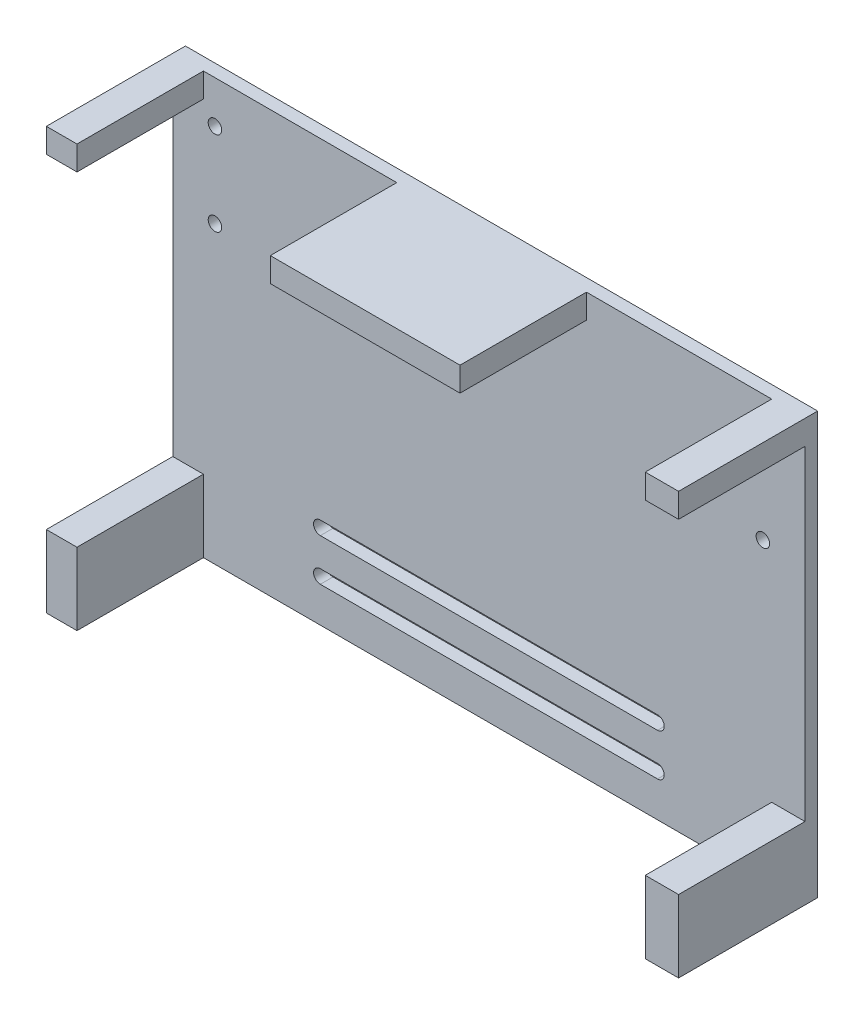
ISO-10303-21;
HEADER;
FILE_DESCRIPTION(('STEP AP214'),'2;1');
FILE_NAME('part.step','',(''),(''),'','','');
FILE_SCHEMA(('AUTOMOTIVE_DESIGN { 1 0 10303 214 1 1 1 1 }'));
ENDSEC;
DATA;
#1=APPLICATION_CONTEXT('core data for automotive mechanical design processes');
#2=APPLICATION_PROTOCOL_DEFINITION('international standard','automotive_design',2000,#1);
#3=PRODUCT_CONTEXT('',#1,'mechanical');
#4=PRODUCT('Part','Part','',(#3));
#5=PRODUCT_RELATED_PRODUCT_CATEGORY('part','',(#4));
#6=PRODUCT_DEFINITION_FORMATION('','',#4);
#7=PRODUCT_DEFINITION_CONTEXT('part definition',#1,'design');
#8=PRODUCT_DEFINITION('design','',#6,#7);
#9=PRODUCT_DEFINITION_SHAPE('','',#8);
#10=(LENGTH_UNIT() NAMED_UNIT(*) SI_UNIT(.MILLI.,.METRE.));
#11=(NAMED_UNIT(*) PLANE_ANGLE_UNIT() SI_UNIT($,.RADIAN.));
#12=(NAMED_UNIT(*) SI_UNIT($,.STERADIAN.) SOLID_ANGLE_UNIT());
#13=UNCERTAINTY_MEASURE_WITH_UNIT(LENGTH_MEASURE(1.E-05),#10,'distance_accuracy_value','');
#14=(GEOMETRIC_REPRESENTATION_CONTEXT(3) GLOBAL_UNCERTAINTY_ASSIGNED_CONTEXT((#13)) GLOBAL_UNIT_ASSIGNED_CONTEXT((#10,
#11,#12)) REPRESENTATION_CONTEXT('',''));
#15=CARTESIAN_POINT('',(0.,0.,0.));
#16=DIRECTION('',(0.,0.,1.));
#17=DIRECTION('',(1.,0.,0.));
#18=AXIS2_PLACEMENT_3D('',#15,#16,#17);
#19=CARTESIAN_POINT('',(0.,0.,3.));
#20=DIRECTION('',(0.,0.,1.));
#21=DIRECTION('',(1.,0.,0.));
#22=AXIS2_PLACEMENT_3D('',#19,#20,#21);
#23=PLANE('',#22);
#24=CARTESIAN_POINT('',(58.2122370936902,-38.671684116065,3.));
#25=DIRECTION('',(0.,0.,1.));
#26=DIRECTION('',(1.,0.,0.));
#27=AXIS2_PLACEMENT_3D('',#24,#25,#26);
#28=CIRCLE('',#27,1.59999999999997);
#29=CARTESIAN_POINT('',(58.2122370936902,-40.271684116065,3.));
#30=VERTEX_POINT('',#29);
#31=CARTESIAN_POINT('',(58.2122370936902,-37.0716841160651,3.));
#32=VERTEX_POINT('',#31);
#33=EDGE_CURVE('E315',#30,#32,#28,.T.);
#34=ORIENTED_EDGE('',*,*,#33,.F.);
#35=DIRECTION('',(1.,0.,0.));
#36=VECTOR('',#35,1.);
#37=CARTESIAN_POINT('',(0.,-40.271684116065,3.));
#38=LINE('',#37,#36);
#39=CARTESIAN_POINT('',(-21.7877629063098,-40.271684116065,3.));
#40=VERTEX_POINT('',#39);
#41=EDGE_CURVE('E307',#40,#30,#38,.T.);
#42=ORIENTED_EDGE('',*,*,#41,.F.);
#43=CARTESIAN_POINT('',(-21.7877629063097,-38.671684116065,3.));
#44=DIRECTION('',(0.,0.,1.));
#45=DIRECTION('',(1.,0.,0.));
#46=AXIS2_PLACEMENT_3D('',#43,#44,#45);
#47=CIRCLE('',#46,1.59999999999997);
#48=CARTESIAN_POINT('',(-21.7877629063098,-37.071684116065,3.));
#49=VERTEX_POINT('',#48);
#50=EDGE_CURVE('E236',#49,#40,#47,.T.);
#51=ORIENTED_EDGE('',*,*,#50,.F.);
#52=DIRECTION('',(-1.,0.,0.));
#53=VECTOR('',#52,1.);
#54=CARTESIAN_POINT('',(0.,-37.071684116065,3.));
#55=LINE('',#54,#53);
#56=EDGE_CURVE('E312',#32,#49,#55,.T.);
#57=ORIENTED_EDGE('',*,*,#56,.F.);
#58=EDGE_LOOP('',(#34,#42,#51,#57));
#59=FACE_BOUND('',#58,.T.);
#60=CARTESIAN_POINT('',(58.2122370936902,-48.671684116065,3.));
#61=DIRECTION('',(0.,0.,1.));
#62=DIRECTION('',(1.,0.,0.));
#63=AXIS2_PLACEMENT_3D('',#60,#61,#62);
#64=CIRCLE('',#63,1.59999999999997);
#65=CARTESIAN_POINT('',(58.2122370936902,-50.271684116065,3.));
#66=VERTEX_POINT('',#65);
#67=CARTESIAN_POINT('',(58.2122370936902,-47.071684116065,3.));
#68=VERTEX_POINT('',#67);
#69=EDGE_CURVE('E304',#66,#68,#64,.T.);
#70=ORIENTED_EDGE('',*,*,#69,.F.);
#71=DIRECTION('',(1.,0.,0.));
#72=VECTOR('',#71,1.);
#73=CARTESIAN_POINT('',(0.,-50.2716841160649,3.));
#74=LINE('',#73,#72);
#75=CARTESIAN_POINT('',(-21.7877629063098,-50.2716841160649,3.));
#76=VERTEX_POINT('',#75);
#77=EDGE_CURVE('E265',#76,#66,#74,.T.);
#78=ORIENTED_EDGE('',*,*,#77,.F.);
#79=CARTESIAN_POINT('',(-21.7877629063097,-48.671684116065,3.));
#80=DIRECTION('',(0.,0.,1.));
#81=DIRECTION('',(1.,0.,0.));
#82=AXIS2_PLACEMENT_3D('',#79,#80,#81);
#83=CIRCLE('',#82,1.59999999999997);
#84=CARTESIAN_POINT('',(-21.7877629063098,-47.071684116065,3.));
#85=VERTEX_POINT('',#84);
#86=EDGE_CURVE('E298',#85,#76,#83,.T.);
#87=ORIENTED_EDGE('',*,*,#86,.F.);
#88=DIRECTION('',(-1.,0.,0.));
#89=VECTOR('',#88,1.);
#90=CARTESIAN_POINT('',(0.,-47.071684116065,3.));
#91=LINE('',#90,#89);
#92=EDGE_CURVE('E301',#68,#85,#91,.T.);
#93=ORIENTED_EDGE('',*,*,#92,.F.);
#94=EDGE_LOOP('',(#70,#78,#87,#93));
#95=FACE_BOUND('',#94,.T.);
#96=DIRECTION('',(-1.,0.,0.));
#97=VECTOR('',#96,1.);
#98=CARTESIAN_POINT('',(-56.7877629063097,-41.5196573009403,3.));
#99=LINE('',#98,#97);
#100=CARTESIAN_POINT('',(-49.5172821614652,-41.5196573009403,3.));
#101=VERTEX_POINT('',#100);
#102=CARTESIAN_POINT('',(-56.7877629063097,-41.5196573009403,3.));
#103=VERTEX_POINT('',#102);
#104=EDGE_CURVE('E434',#101,#103,#99,.T.);
#105=ORIENTED_EDGE('',*,*,#104,.F.);
#106=DIRECTION('',(0.,1.,0.));
#107=VECTOR('',#106,1.);
#108=CARTESIAN_POINT('',(-49.5172821614652,-58.671684116065,3.));
#109=LINE('',#108,#107);
#110=CARTESIAN_POINT('',(-49.5172821614652,-58.671684116065,3.));
#111=VERTEX_POINT('',#110);
#112=EDGE_CURVE('E393',#111,#101,#109,.T.);
#113=ORIENTED_EDGE('',*,*,#112,.F.);
#114=DIRECTION('',(1.,0.,0.));
#115=VECTOR('',#114,1.);
#116=CARTESIAN_POINT('',(-56.7877629063097,-58.671684116065,3.));
#117=LINE('',#116,#115);
#118=CARTESIAN_POINT('',(85.311019940881,-58.671684116065,3.));
#119=VERTEX_POINT('',#118);
#120=EDGE_CURVE('E529',#111,#119,#117,.T.);
#121=ORIENTED_EDGE('',*,*,#120,.T.);
#122=DIRECTION('',(0.,-1.,0.));
#123=VECTOR('',#122,1.);
#124=CARTESIAN_POINT('',(85.311019940881,-58.671684116065,3.));
#125=LINE('',#124,#123);
#126=CARTESIAN_POINT('',(85.311019940881,-41.5196573009403,3.));
#127=VERTEX_POINT('',#126);
#128=EDGE_CURVE('E402',#127,#119,#125,.T.);
#129=ORIENTED_EDGE('',*,*,#128,.F.);
#130=DIRECTION('',(-1.,0.,0.));
#131=VECTOR('',#130,1.);
#132=CARTESIAN_POINT('',(93.2122370936903,-41.5196573009403,3.));
#133=LINE('',#132,#131);
#134=CARTESIAN_POINT('',(93.2122370936903,-41.5196573009403,3.));
#135=VERTEX_POINT('',#134);
#136=EDGE_CURVE('E360',#135,#127,#133,.T.);
#137=ORIENTED_EDGE('',*,*,#136,.F.);
#138=DIRECTION('',(0.,1.,0.));
#139=VECTOR('',#138,1.);
#140=CARTESIAN_POINT('',(93.2122370936902,41.328315883935,3.));
#141=LINE('',#140,#139);
#142=CARTESIAN_POINT('',(93.2122370936902,35.5739545762803,3.));
#143=VERTEX_POINT('',#142);
#144=EDGE_CURVE('E533',#135,#143,#141,.T.);
#145=ORIENTED_EDGE('',*,*,#144,.T.);
#146=DIRECTION('',(1.,0.,0.));
#147=VECTOR('',#146,1.);
#148=CARTESIAN_POINT('',(93.2122370936902,35.5739545762803,3.));
#149=LINE('',#148,#147);
#150=CARTESIAN_POINT('',(85.311019940881,35.5739545762803,3.));
#151=VERTEX_POINT('',#150);
#152=EDGE_CURVE('E369',#151,#143,#149,.T.);
#153=ORIENTED_EDGE('',*,*,#152,.F.);
#154=DIRECTION('',(0.,-1.,0.));
#155=VECTOR('',#154,1.);
#156=CARTESIAN_POINT('',(85.311019940881,41.328315883935,3.));
#157=LINE('',#156,#155);
#158=CARTESIAN_POINT('',(85.311019940881,41.328315883935,3.));
#159=VERTEX_POINT('',#158);
#160=EDGE_CURVE('E324',#159,#151,#157,.T.);
#161=ORIENTED_EDGE('',*,*,#160,.F.);
#162=DIRECTION('',(-1.,0.,0.));
#163=VECTOR('',#162,1.);
#164=CARTESIAN_POINT('',(-56.7877629063098,41.328315883935,3.));
#165=LINE('',#164,#163);
#166=CARTESIAN_POINT('',(41.3610431680918,41.328315883935,3.));
#167=VERTEX_POINT('',#166);
#168=EDGE_CURVE('E539',#159,#167,#165,.T.);
#169=ORIENTED_EDGE('',*,*,#168,.T.);
#170=DIRECTION('',(0.,1.,0.));
#171=VECTOR('',#170,1.);
#172=CARTESIAN_POINT('',(41.3610431680918,41.328315883935,3.));
#173=LINE('',#172,#171);
#174=CARTESIAN_POINT('',(41.3610431680918,35.5739545762803,3.));
#175=VERTEX_POINT('',#174);
#176=EDGE_CURVE('E458',#175,#167,#173,.T.);
#177=ORIENTED_EDGE('',*,*,#176,.F.);
#178=DIRECTION('',(1.,0.,0.));
#179=VECTOR('',#178,1.);
#180=CARTESIAN_POINT('',(-3.65186093510339,35.5739545762803,3.));
#181=LINE('',#180,#179);
#182=CARTESIAN_POINT('',(-3.65186093510339,35.5739545762803,3.));
#183=VERTEX_POINT('',#182);
#184=EDGE_CURVE('E471',#183,#175,#181,.T.);
#185=ORIENTED_EDGE('',*,*,#184,.F.);
#186=DIRECTION('',(0.,-1.,0.));
#187=VECTOR('',#186,1.);
#188=CARTESIAN_POINT('',(-3.65186093510339,41.328315883935,3.));
#189=LINE('',#188,#187);
#190=CARTESIAN_POINT('',(-3.65186093510339,41.328315883935,3.));
#191=VERTEX_POINT('',#190);
#192=EDGE_CURVE('E342',#191,#183,#189,.T.);
#193=ORIENTED_EDGE('',*,*,#192,.F.);
#194=CARTESIAN_POINT('',(-49.5172821614652,41.328315883935,3.));
#195=VERTEX_POINT('',#194);
#196=EDGE_CURVE('E536',#191,#195,#165,.T.);
#197=ORIENTED_EDGE('',*,*,#196,.T.);
#198=DIRECTION('',(0.,1.,0.));
#199=VECTOR('',#198,1.);
#200=CARTESIAN_POINT('',(-49.5172821614652,41.328315883935,3.));
#201=LINE('',#200,#199);
#202=CARTESIAN_POINT('',(-49.5172821614652,35.5739545762803,3.));
#203=VERTEX_POINT('',#202);
#204=EDGE_CURVE('E333',#203,#195,#201,.T.);
#205=ORIENTED_EDGE('',*,*,#204,.F.);
#206=DIRECTION('',(1.,0.,0.));
#207=VECTOR('',#206,1.);
#208=CARTESIAN_POINT('',(-56.7877629063098,35.5739545762803,3.));
#209=LINE('',#208,#207);
#210=CARTESIAN_POINT('',(-56.7877629063098,35.5739545762803,3.));
#211=VERTEX_POINT('',#210);
#212=EDGE_CURVE('E337',#211,#203,#209,.T.);
#213=ORIENTED_EDGE('',*,*,#212,.F.);
#214=DIRECTION('',(0.,-1.,0.));
#215=VECTOR('',#214,1.);
#216=CARTESIAN_POINT('',(-56.7877629063098,41.328315883935,3.));
#217=LINE('',#216,#215);
#218=EDGE_CURVE('E526',#211,#103,#217,.T.);
#219=ORIENTED_EDGE('',*,*,#218,.T.);
#220=EDGE_LOOP('',(#105,#113,#121,#129,#137,#145,#153,#161,#169,#177,#185,#193,#197,#205,#213,#219));
#221=FACE_BOUND('',#220,.T.);
#222=CARTESIAN_POINT('',(83.2122370936903,11.3283158839351,3.));
#223=DIRECTION('',(0.,0.,1.));
#224=DIRECTION('',(-1.,0.,0.));
#225=AXIS2_PLACEMENT_3D('',#222,#223,#224);
#226=CIRCLE('',#225,1.59999999999999);
#227=CARTESIAN_POINT('',(81.6122370936903,11.3283158839351,3.));
#228=VERTEX_POINT('',#227);
#229=EDGE_CURVE('E502',#228,#228,#226,.T.);
#230=ORIENTED_EDGE('',*,*,#229,.F.);
#231=EDGE_LOOP('',(#230));
#232=FACE_BOUND('',#231,.T.);
#233=CARTESIAN_POINT('',(-46.7877629063098,31.328315883935,3.));
#234=DIRECTION('',(0.,0.,1.));
#235=DIRECTION('',(1.,0.,0.));
#236=AXIS2_PLACEMENT_3D('',#233,#234,#235);
#237=CIRCLE('',#236,1.6);
#238=CARTESIAN_POINT('',(-45.1877629063098,31.328315883935,3.));
#239=VERTEX_POINT('',#238);
#240=EDGE_CURVE('E518',#239,#239,#237,.T.);
#241=ORIENTED_EDGE('',*,*,#240,.F.);
#242=EDGE_LOOP('',(#241));
#243=FACE_BOUND('',#242,.T.);
#244=CARTESIAN_POINT('',(-46.7877629063098,11.328315883935,3.));
#245=DIRECTION('',(0.,0.,1.));
#246=DIRECTION('',(1.,0.,0.));
#247=AXIS2_PLACEMENT_3D('',#244,#245,#246);
#248=CIRCLE('',#247,1.6);
#249=CARTESIAN_POINT('',(-45.1877629063098,11.328315883935,3.));
#250=VERTEX_POINT('',#249);
#251=EDGE_CURVE('E510',#250,#250,#248,.T.);
#252=ORIENTED_EDGE('',*,*,#251,.F.);
#253=EDGE_LOOP('',(#252));
#254=FACE_BOUND('',#253,.T.);
#255=CARTESIAN_POINT('',(83.2122370936902,31.3283158839351,3.));
#256=DIRECTION('',(0.,0.,1.));
#257=DIRECTION('',(-1.,0.,0.));
#258=AXIS2_PLACEMENT_3D('',#255,#256,#257);
#259=CIRCLE('',#258,1.59999999999999);
#260=CARTESIAN_POINT('',(81.6122370936903,31.3283158839351,3.));
#261=VERTEX_POINT('',#260);
#262=EDGE_CURVE('E494',#261,#261,#259,.T.);
#263=ORIENTED_EDGE('',*,*,#262,.F.);
#264=EDGE_LOOP('',(#263));
#265=FACE_BOUND('',#264,.T.);
#266=ADVANCED_FACE('F45',(#59,#95,#221,#232,#243,#254,#265),#23,.T.);
#267=CARTESIAN_POINT('',(0.,0.,0.));
#268=DIRECTION('',(0.,0.,1.));
#269=DIRECTION('',(1.,0.,0.));
#270=AXIS2_PLACEMENT_3D('',#267,#268,#269);
#271=PLANE('',#270);
#272=DIRECTION('',(-1.,0.,0.));
#273=VECTOR('',#272,1.);
#274=CARTESIAN_POINT('',(58.2122370936902,-40.271684116065,0.));
#275=LINE('',#274,#273);
#276=CARTESIAN_POINT('',(58.2122370936902,-40.271684116065,0.));
#277=VERTEX_POINT('',#276);
#278=CARTESIAN_POINT('',(-21.7877629063098,-40.271684116065,0.));
#279=VERTEX_POINT('',#278);
#280=EDGE_CURVE('E244',#277,#279,#275,.T.);
#281=ORIENTED_EDGE('',*,*,#280,.F.);
#282=CARTESIAN_POINT('',(58.2122370936902,-38.671684116065,0.));
#283=DIRECTION('',(0.,0.,-1.));
#284=DIRECTION('',(-1.,0.,0.));
#285=AXIS2_PLACEMENT_3D('',#282,#283,#284);
#286=CIRCLE('',#285,1.59999999999997);
#287=CARTESIAN_POINT('',(58.2122370936902,-37.0716841160651,0.));
#288=VERTEX_POINT('',#287);
#289=EDGE_CURVE('E250',#288,#277,#286,.T.);
#290=ORIENTED_EDGE('',*,*,#289,.F.);
#291=DIRECTION('',(1.,0.,0.));
#292=VECTOR('',#291,1.);
#293=CARTESIAN_POINT('',(58.2122370936902,-37.0716841160651,0.));
#294=LINE('',#293,#292);
#295=CARTESIAN_POINT('',(-21.7877629063098,-37.071684116065,0.));
#296=VERTEX_POINT('',#295);
#297=EDGE_CURVE('E255',#296,#288,#294,.T.);
#298=ORIENTED_EDGE('',*,*,#297,.F.);
#299=CARTESIAN_POINT('',(-21.7877629063097,-38.671684116065,0.));
#300=DIRECTION('',(0.,0.,-1.));
#301=DIRECTION('',(-1.,0.,0.));
#302=AXIS2_PLACEMENT_3D('',#299,#300,#301);
#303=CIRCLE('',#302,1.59999999999997);
#304=EDGE_CURVE('E233',#279,#296,#303,.T.);
#305=ORIENTED_EDGE('',*,*,#304,.F.);
#306=EDGE_LOOP('',(#281,#290,#298,#305));
#307=FACE_BOUND('',#306,.T.);
#308=DIRECTION('',(-1.,0.,0.));
#309=VECTOR('',#308,1.);
#310=CARTESIAN_POINT('',(58.2122370936902,-50.271684116065,0.));
#311=LINE('',#310,#309);
#312=CARTESIAN_POINT('',(58.2122370936902,-50.271684116065,0.));
#313=VERTEX_POINT('',#312);
#314=CARTESIAN_POINT('',(-21.7877629063098,-50.271684116065,0.));
#315=VERTEX_POINT('',#314);
#316=EDGE_CURVE('E290',#313,#315,#311,.T.);
#317=ORIENTED_EDGE('',*,*,#316,.F.);
#318=CARTESIAN_POINT('',(58.2122370936902,-48.671684116065,0.));
#319=DIRECTION('',(0.,0.,-1.));
#320=DIRECTION('',(-1.,0.,0.));
#321=AXIS2_PLACEMENT_3D('',#318,#319,#320);
#322=CIRCLE('',#321,1.59999999999997);
#323=CARTESIAN_POINT('',(58.2122370936902,-47.071684116065,0.));
#324=VERTEX_POINT('',#323);
#325=EDGE_CURVE('E293',#324,#313,#322,.T.);
#326=ORIENTED_EDGE('',*,*,#325,.F.);
#327=DIRECTION('',(1.,0.,0.));
#328=VECTOR('',#327,1.);
#329=CARTESIAN_POINT('',(58.2122370936902,-47.071684116065,0.));
#330=LINE('',#329,#328);
#331=CARTESIAN_POINT('',(-21.7877629063098,-47.071684116065,0.));
#332=VERTEX_POINT('',#331);
#333=EDGE_CURVE('E274',#332,#324,#330,.T.);
#334=ORIENTED_EDGE('',*,*,#333,.F.);
#335=CARTESIAN_POINT('',(-21.7877629063097,-48.671684116065,0.));
#336=DIRECTION('',(0.,0.,-1.));
#337=DIRECTION('',(-1.,0.,0.));
#338=AXIS2_PLACEMENT_3D('',#335,#336,#337);
#339=CIRCLE('',#338,1.59999999999997);
#340=EDGE_CURVE('E286',#315,#332,#339,.T.);
#341=ORIENTED_EDGE('',*,*,#340,.F.);
#342=EDGE_LOOP('',(#317,#326,#334,#341));
#343=FACE_BOUND('',#342,.T.);
#344=DIRECTION('',(0.,-1.,0.));
#345=VECTOR('',#344,1.);
#346=CARTESIAN_POINT('',(-56.7877629063098,41.328315883935,0.));
#347=LINE('',#346,#345);
#348=CARTESIAN_POINT('',(-56.7877629063098,41.328315883935,0.));
#349=VERTEX_POINT('',#348);
#350=CARTESIAN_POINT('',(-56.7877629063097,-58.671684116065,0.));
#351=VERTEX_POINT('',#350);
#352=EDGE_CURVE('E522',#349,#351,#347,.T.);
#353=ORIENTED_EDGE('',*,*,#352,.F.);
#354=DIRECTION('',(-1.,0.,0.));
#355=VECTOR('',#354,1.);
#356=CARTESIAN_POINT('',(-56.7877629063098,41.328315883935,0.));
#357=LINE('',#356,#355);
#358=CARTESIAN_POINT('',(93.2122370936902,41.328315883935,0.));
#359=VERTEX_POINT('',#358);
#360=EDGE_CURVE('E530',#359,#349,#357,.T.);
#361=ORIENTED_EDGE('',*,*,#360,.F.);
#362=DIRECTION('',(0.,1.,0.));
#363=VECTOR('',#362,1.);
#364=CARTESIAN_POINT('',(93.2122370936902,41.328315883935,0.));
#365=LINE('',#364,#363);
#366=CARTESIAN_POINT('',(93.2122370936903,-58.671684116065,0.));
#367=VERTEX_POINT('',#366);
#368=EDGE_CURVE('E546',#367,#359,#365,.T.);
#369=ORIENTED_EDGE('',*,*,#368,.F.);
#370=DIRECTION('',(1.,0.,0.));
#371=VECTOR('',#370,1.);
#372=CARTESIAN_POINT('',(-56.7877629063097,-58.671684116065,0.));
#373=LINE('',#372,#371);
#374=EDGE_CURVE('E543',#351,#367,#373,.T.);
#375=ORIENTED_EDGE('',*,*,#374,.F.);
#376=EDGE_LOOP('',(#353,#361,#369,#375));
#377=FACE_BOUND('',#376,.T.);
#378=CARTESIAN_POINT('',(-46.7877629063098,31.328315883935,0.));
#379=DIRECTION('',(0.,0.,1.));
#380=DIRECTION('',(1.,0.,0.));
#381=AXIS2_PLACEMENT_3D('',#378,#379,#380);
#382=CIRCLE('',#381,1.6);
#383=CARTESIAN_POINT('',(-45.1877629063098,31.328315883935,0.));
#384=VERTEX_POINT('',#383);
#385=EDGE_CURVE('E514',#384,#384,#382,.T.);
#386=ORIENTED_EDGE('',*,*,#385,.T.);
#387=EDGE_LOOP('',(#386));
#388=FACE_BOUND('',#387,.T.);
#389=CARTESIAN_POINT('',(-46.7877629063098,11.328315883935,0.));
#390=DIRECTION('',(0.,0.,1.));
#391=DIRECTION('',(1.,0.,0.));
#392=AXIS2_PLACEMENT_3D('',#389,#390,#391);
#393=CIRCLE('',#392,1.6);
#394=CARTESIAN_POINT('',(-45.1877629063098,11.328315883935,0.));
#395=VERTEX_POINT('',#394);
#396=EDGE_CURVE('E506',#395,#395,#393,.T.);
#397=ORIENTED_EDGE('',*,*,#396,.T.);
#398=EDGE_LOOP('',(#397));
#399=FACE_BOUND('',#398,.T.);
#400=CARTESIAN_POINT('',(83.2122370936903,11.3283158839351,0.));
#401=DIRECTION('',(0.,0.,1.));
#402=DIRECTION('',(-1.,0.,0.));
#403=AXIS2_PLACEMENT_3D('',#400,#401,#402);
#404=CIRCLE('',#403,1.59999999999999);
#405=CARTESIAN_POINT('',(81.6122370936903,11.3283158839351,0.));
#406=VERTEX_POINT('',#405);
#407=EDGE_CURVE('E498',#406,#406,#404,.T.);
#408=ORIENTED_EDGE('',*,*,#407,.T.);
#409=EDGE_LOOP('',(#408));
#410=FACE_BOUND('',#409,.T.);
#411=CARTESIAN_POINT('',(83.2122370936902,31.3283158839351,0.));
#412=DIRECTION('',(0.,0.,1.));
#413=DIRECTION('',(-1.,0.,0.));
#414=AXIS2_PLACEMENT_3D('',#411,#412,#413);
#415=CIRCLE('',#414,1.59999999999999);
#416=CARTESIAN_POINT('',(81.6122370936903,31.3283158839351,0.));
#417=VERTEX_POINT('',#416);
#418=EDGE_CURVE('E493',#417,#417,#415,.T.);
#419=ORIENTED_EDGE('',*,*,#418,.T.);
#420=EDGE_LOOP('',(#419));
#421=FACE_BOUND('',#420,.T.);
#422=ADVANCED_FACE('F252',(#307,#343,#377,#388,#399,#410,#421),#271,.F.);
#423=CARTESIAN_POINT('',(-56.7877629063098,41.328315883935,3.));
#424=DIRECTION('',(1.,0.,0.));
#425=DIRECTION('',(0.,1.,0.));
#426=AXIS2_PLACEMENT_3D('',#423,#424,#425);
#427=PLANE('',#426);
#428=ORIENTED_EDGE('',*,*,#352,.T.);
#429=DIRECTION('',(0.,0.,-1.));
#430=VECTOR('',#429,1.);
#431=CARTESIAN_POINT('',(-56.7877629063097,-58.671684116065,3.));
#432=LINE('',#431,#430);
#433=CARTESIAN_POINT('',(-56.7877629063097,-58.671684116065,33.));
#434=VERTEX_POINT('',#433);
#435=EDGE_CURVE('E11',#434,#351,#432,.T.);
#436=ORIENTED_EDGE('',*,*,#435,.F.);
#437=DIRECTION('',(0.,-1.,0.));
#438=VECTOR('',#437,1.);
#439=CARTESIAN_POINT('',(-56.7877629063097,-58.671684116065,33.));
#440=LINE('',#439,#438);
#441=CARTESIAN_POINT('',(-56.7877629063097,-41.5196573009403,33.));
#442=VERTEX_POINT('',#441);
#443=EDGE_CURVE('E438',#442,#434,#440,.T.);
#444=ORIENTED_EDGE('',*,*,#443,.F.);
#445=DIRECTION('',(0.,0.,-1.));
#446=VECTOR('',#445,1.);
#447=CARTESIAN_POINT('',(-56.7877629063097,-41.5196573009403,33.));
#448=LINE('',#447,#446);
#449=EDGE_CURVE('E429',#442,#103,#448,.T.);
#450=ORIENTED_EDGE('',*,*,#449,.T.);
#451=ORIENTED_EDGE('',*,*,#218,.F.);
#452=DIRECTION('',(0.,0.,-1.));
#453=VECTOR('',#452,1.);
#454=CARTESIAN_POINT('',(-56.7877629063098,35.5739545762803,33.));
#455=LINE('',#454,#453);
#456=CARTESIAN_POINT('',(-56.7877629063098,35.5739545762803,33.));
#457=VERTEX_POINT('',#456);
#458=EDGE_CURVE('E319',#457,#211,#455,.T.);
#459=ORIENTED_EDGE('',*,*,#458,.F.);
#460=DIRECTION('',(0.,-1.,0.));
#461=VECTOR('',#460,1.);
#462=CARTESIAN_POINT('',(-56.7877629063098,41.328315883935,33.));
#463=LINE('',#462,#461);
#464=CARTESIAN_POINT('',(-56.7877629063098,41.328315883935,33.));
#465=VERTEX_POINT('',#464);
#466=EDGE_CURVE('E338',#465,#457,#463,.T.);
#467=ORIENTED_EDGE('',*,*,#466,.F.);
#468=DIRECTION('',(0.,0.,-1.));
#469=VECTOR('',#468,1.);
#470=CARTESIAN_POINT('',(-56.7877629063098,41.328315883935,3.));
#471=LINE('',#470,#469);
#472=EDGE_CURVE('E551',#465,#349,#471,.T.);
#473=ORIENTED_EDGE('',*,*,#472,.T.);
#474=EDGE_LOOP('',(#428,#436,#444,#450,#451,#459,#467,#473));
#475=FACE_BOUND('',#474,.T.);
#476=ADVANCED_FACE('F47',(#475),#427,.F.);
#477=CARTESIAN_POINT('',(-56.7877629063097,-58.671684116065,3.));
#478=DIRECTION('',(0.,1.,0.));
#479=DIRECTION('',(-1.,0.,0.));
#480=AXIS2_PLACEMENT_3D('',#477,#478,#479);
#481=PLANE('',#480);
#482=ORIENTED_EDGE('',*,*,#374,.T.);
#483=DIRECTION('',(0.,0.,-1.));
#484=VECTOR('',#483,1.);
#485=CARTESIAN_POINT('',(93.2122370936903,-58.671684116065,3.));
#486=LINE('',#485,#484);
#487=CARTESIAN_POINT('',(93.2122370936903,-58.671684116065,33.));
#488=VERTEX_POINT('',#487);
#489=EDGE_CURVE('E54',#488,#367,#486,.T.);
#490=ORIENTED_EDGE('',*,*,#489,.F.);
#491=DIRECTION('',(1.,0.,0.));
#492=VECTOR('',#491,1.);
#493=CARTESIAN_POINT('',(93.2122370936903,-58.671684116065,33.));
#494=LINE('',#493,#492);
#495=CARTESIAN_POINT('',(85.311019940881,-58.671684116065,33.));
#496=VERTEX_POINT('',#495);
#497=EDGE_CURVE('E401',#496,#488,#494,.T.);
#498=ORIENTED_EDGE('',*,*,#497,.F.);
#499=DIRECTION('',(0.,0.,-1.));
#500=VECTOR('',#499,1.);
#501=CARTESIAN_POINT('',(85.311019940881,-58.671684116065,33.));
#502=LINE('',#501,#500);
#503=EDGE_CURVE('E397',#496,#119,#502,.T.);
#504=ORIENTED_EDGE('',*,*,#503,.T.);
#505=ORIENTED_EDGE('',*,*,#120,.F.);
#506=DIRECTION('',(0.,0.,-1.));
#507=VECTOR('',#506,1.);
#508=CARTESIAN_POINT('',(-49.5172821614652,-58.671684116065,33.));
#509=LINE('',#508,#507);
#510=CARTESIAN_POINT('',(-49.5172821614652,-58.671684116065,33.));
#511=VERTEX_POINT('',#510);
#512=EDGE_CURVE('E318',#511,#111,#509,.T.);
#513=ORIENTED_EDGE('',*,*,#512,.F.);
#514=DIRECTION('',(1.,0.,0.));
#515=VECTOR('',#514,1.);
#516=CARTESIAN_POINT('',(-56.7877629063097,-58.671684116065,33.));
#517=LINE('',#516,#515);
#518=EDGE_CURVE('E447',#434,#511,#517,.T.);
#519=ORIENTED_EDGE('',*,*,#518,.F.);
#520=ORIENTED_EDGE('',*,*,#435,.T.);
#521=EDGE_LOOP('',(#482,#490,#498,#504,#505,#513,#519,#520));
#522=FACE_BOUND('',#521,.T.);
#523=ADVANCED_FACE('F621',(#522),#481,.F.);
#524=CARTESIAN_POINT('',(93.2122370936902,41.328315883935,3.));
#525=DIRECTION('',(-1.,0.,0.));
#526=DIRECTION('',(0.,-1.,0.));
#527=AXIS2_PLACEMENT_3D('',#524,#525,#526);
#528=PLANE('',#527);
#529=ORIENTED_EDGE('',*,*,#368,.T.);
#530=DIRECTION('',(0.,0.,-1.));
#531=VECTOR('',#530,1.);
#532=CARTESIAN_POINT('',(93.2122370936902,41.328315883935,3.));
#533=LINE('',#532,#531);
#534=CARTESIAN_POINT('',(93.2122370936902,41.328315883935,33.));
#535=VERTEX_POINT('',#534);
#536=EDGE_CURVE('E555',#535,#359,#533,.T.);
#537=ORIENTED_EDGE('',*,*,#536,.F.);
#538=DIRECTION('',(0.,1.,0.));
#539=VECTOR('',#538,1.);
#540=CARTESIAN_POINT('',(93.2122370936902,41.328315883935,33.));
#541=LINE('',#540,#539);
#542=CARTESIAN_POINT('',(93.2122370936902,35.5739545762803,33.));
#543=VERTEX_POINT('',#542);
#544=EDGE_CURVE('E373',#543,#535,#541,.T.);
#545=ORIENTED_EDGE('',*,*,#544,.F.);
#546=DIRECTION('',(0.,0.,-1.));
#547=VECTOR('',#546,1.);
#548=CARTESIAN_POINT('',(93.2122370936902,35.5739545762803,33.));
#549=LINE('',#548,#547);
#550=EDGE_CURVE('E364',#543,#143,#549,.T.);
#551=ORIENTED_EDGE('',*,*,#550,.T.);
#552=ORIENTED_EDGE('',*,*,#144,.F.);
#553=DIRECTION('',(0.,0.,-1.));
#554=VECTOR('',#553,1.);
#555=CARTESIAN_POINT('',(93.2122370936903,-41.5196573009403,33.));
#556=LINE('',#555,#554);
#557=CARTESIAN_POINT('',(93.2122370936903,-41.5196573009403,33.));
#558=VERTEX_POINT('',#557);
#559=EDGE_CURVE('E388',#558,#135,#556,.T.);
#560=ORIENTED_EDGE('',*,*,#559,.F.);
#561=DIRECTION('',(0.,1.,0.));
#562=VECTOR('',#561,1.);
#563=CARTESIAN_POINT('',(93.2122370936903,-58.671684116065,33.));
#564=LINE('',#563,#562);
#565=EDGE_CURVE('E406',#488,#558,#564,.T.);
#566=ORIENTED_EDGE('',*,*,#565,.F.);
#567=ORIENTED_EDGE('',*,*,#489,.T.);
#568=EDGE_LOOP('',(#529,#537,#545,#551,#552,#560,#566,#567));
#569=FACE_BOUND('',#568,.T.);
#570=ADVANCED_FACE('F563',(#569),#528,.F.);
#571=CARTESIAN_POINT('',(-56.7877629063098,41.328315883935,3.));
#572=DIRECTION('',(0.,-1.,0.));
#573=DIRECTION('',(1.,0.,0.));
#574=AXIS2_PLACEMENT_3D('',#571,#572,#573);
#575=PLANE('',#574);
#576=ORIENTED_EDGE('',*,*,#360,.T.);
#577=ORIENTED_EDGE('',*,*,#472,.F.);
#578=DIRECTION('',(-1.,0.,0.));
#579=VECTOR('',#578,1.);
#580=CARTESIAN_POINT('',(-56.7877629063098,41.328315883935,33.));
#581=LINE('',#580,#579);
#582=CARTESIAN_POINT('',(-49.5172821614652,41.328315883935,33.));
#583=VERTEX_POINT('',#582);
#584=EDGE_CURVE('E332',#583,#465,#581,.T.);
#585=ORIENTED_EDGE('',*,*,#584,.F.);
#586=DIRECTION('',(0.,0.,-1.));
#587=VECTOR('',#586,1.);
#588=CARTESIAN_POINT('',(-49.5172821614652,41.328315883935,33.));
#589=LINE('',#588,#587);
#590=EDGE_CURVE('E328',#583,#195,#589,.T.);
#591=ORIENTED_EDGE('',*,*,#590,.T.);
#592=ORIENTED_EDGE('',*,*,#196,.F.);
#593=DIRECTION('',(0.,0.,-1.));
#594=VECTOR('',#593,1.);
#595=CARTESIAN_POINT('',(-3.65186093510339,41.328315883935,33.));
#596=LINE('',#595,#594);
#597=CARTESIAN_POINT('',(-3.65186093510339,41.328315883935,33.));
#598=VERTEX_POINT('',#597);
#599=EDGE_CURVE('E467',#598,#191,#596,.T.);
#600=ORIENTED_EDGE('',*,*,#599,.F.);
#601=DIRECTION('',(-1.,0.,0.));
#602=VECTOR('',#601,1.);
#603=CARTESIAN_POINT('',(-3.65186093510339,41.328315883935,33.));
#604=LINE('',#603,#602);
#605=CARTESIAN_POINT('',(41.3610431680918,41.328315883935,33.));
#606=VERTEX_POINT('',#605);
#607=EDGE_CURVE('E464',#606,#598,#604,.T.);
#608=ORIENTED_EDGE('',*,*,#607,.F.);
#609=DIRECTION('',(0.,0.,-1.));
#610=VECTOR('',#609,1.);
#611=CARTESIAN_POINT('',(41.3610431680918,41.328315883935,33.));
#612=LINE('',#611,#610);
#613=EDGE_CURVE('E481',#606,#167,#612,.T.);
#614=ORIENTED_EDGE('',*,*,#613,.T.);
#615=ORIENTED_EDGE('',*,*,#168,.F.);
#616=DIRECTION('',(0.,0.,-1.));
#617=VECTOR('',#616,1.);
#618=CARTESIAN_POINT('',(85.311019940881,41.328315883935,33.));
#619=LINE('',#618,#617);
#620=CARTESIAN_POINT('',(85.311019940881,41.328315883935,33.));
#621=VERTEX_POINT('',#620);
#622=EDGE_CURVE('E355',#621,#159,#619,.T.);
#623=ORIENTED_EDGE('',*,*,#622,.F.);
#624=DIRECTION('',(-1.,0.,0.));
#625=VECTOR('',#624,1.);
#626=CARTESIAN_POINT('',(93.2122370936902,41.328315883935,33.));
#627=LINE('',#626,#625);
#628=EDGE_CURVE('E382',#535,#621,#627,.T.);
#629=ORIENTED_EDGE('',*,*,#628,.F.);
#630=ORIENTED_EDGE('',*,*,#536,.T.);
#631=EDGE_LOOP('',(#576,#577,#585,#591,#592,#600,#608,#614,#615,#623,#629,#630));
#632=FACE_BOUND('',#631,.T.);
#633=ADVANCED_FACE('F572',(#632),#575,.F.);
#634=CARTESIAN_POINT('',(-46.7877629063098,31.328315883935,3.));
#635=DIRECTION('',(0.,0.,-1.));
#636=DIRECTION('',(-1.,0.,0.));
#637=AXIS2_PLACEMENT_3D('',#634,#635,#636);
#638=CYLINDRICAL_SURFACE('',#637,1.6);
#639=ORIENTED_EDGE('',*,*,#240,.T.);
#640=EDGE_LOOP('',(#639));
#641=FACE_BOUND('',#640,.T.);
#642=ORIENTED_EDGE('',*,*,#385,.F.);
#643=EDGE_LOOP('',(#642));
#644=FACE_BOUND('',#643,.T.);
#645=ADVANCED_FACE('F615',(#641,#644),#638,.F.);
#646=CARTESIAN_POINT('',(-46.7877629063098,11.328315883935,3.));
#647=DIRECTION('',(0.,0.,-1.));
#648=DIRECTION('',(-1.,0.,0.));
#649=AXIS2_PLACEMENT_3D('',#646,#647,#648);
#650=CYLINDRICAL_SURFACE('',#649,1.6);
#651=ORIENTED_EDGE('',*,*,#251,.T.);
#652=EDGE_LOOP('',(#651));
#653=FACE_BOUND('',#652,.T.);
#654=ORIENTED_EDGE('',*,*,#396,.F.);
#655=EDGE_LOOP('',(#654));
#656=FACE_BOUND('',#655,.T.);
#657=ADVANCED_FACE('F685',(#653,#656),#650,.F.);
#658=CARTESIAN_POINT('',(83.2122370936903,11.3283158839351,3.));
#659=DIRECTION('',(0.,0.,-1.));
#660=DIRECTION('',(-1.,0.,0.));
#661=AXIS2_PLACEMENT_3D('',#658,#659,#660);
#662=CYLINDRICAL_SURFACE('',#661,1.59999999999999);
#663=ORIENTED_EDGE('',*,*,#229,.T.);
#664=EDGE_LOOP('',(#663));
#665=FACE_BOUND('',#664,.T.);
#666=ORIENTED_EDGE('',*,*,#407,.F.);
#667=EDGE_LOOP('',(#666));
#668=FACE_BOUND('',#667,.T.);
#669=ADVANCED_FACE('F679',(#665,#668),#662,.F.);
#670=CARTESIAN_POINT('',(83.2122370936902,31.3283158839351,3.));
#671=DIRECTION('',(0.,0.,-1.));
#672=DIRECTION('',(-1.,0.,0.));
#673=AXIS2_PLACEMENT_3D('',#670,#671,#672);
#674=CYLINDRICAL_SURFACE('',#673,1.59999999999999);
#675=ORIENTED_EDGE('',*,*,#262,.T.);
#676=EDGE_LOOP('',(#675));
#677=FACE_BOUND('',#676,.T.);
#678=ORIENTED_EDGE('',*,*,#418,.F.);
#679=EDGE_LOOP('',(#678));
#680=FACE_BOUND('',#679,.T.);
#681=ADVANCED_FACE('F672',(#677,#680),#674,.F.);
#682=CARTESIAN_POINT('',(-3.65186093510339,41.328315883935,33.));
#683=DIRECTION('',(1.,0.,0.));
#684=DIRECTION('',(0.,0.,-1.));
#685=AXIS2_PLACEMENT_3D('',#682,#683,#684);
#686=PLANE('',#685);
#687=ORIENTED_EDGE('',*,*,#192,.T.);
#688=DIRECTION('',(0.,0.,-1.));
#689=VECTOR('',#688,1.);
#690=CARTESIAN_POINT('',(-3.65186093510339,35.5739545762803,33.));
#691=LINE('',#690,#689);
#692=CARTESIAN_POINT('',(-3.65186093510339,35.5739545762803,33.));
#693=VERTEX_POINT('',#692);
#694=EDGE_CURVE('E489',#693,#183,#691,.T.);
#695=ORIENTED_EDGE('',*,*,#694,.F.);
#696=DIRECTION('',(0.,-1.,0.));
#697=VECTOR('',#696,1.);
#698=CARTESIAN_POINT('',(-3.65186093510339,41.328315883935,33.));
#699=LINE('',#698,#697);
#700=EDGE_CURVE('E453',#598,#693,#699,.T.);
#701=ORIENTED_EDGE('',*,*,#700,.F.);
#702=ORIENTED_EDGE('',*,*,#599,.T.);
#703=EDGE_LOOP('',(#687,#695,#701,#702));
#704=FACE_BOUND('',#703,.T.);
#705=ADVANCED_FACE('F669',(#704),#686,.F.);
#706=CARTESIAN_POINT('',(-3.65186093510339,35.5739545762803,33.));
#707=DIRECTION('',(0.,1.,0.));
#708=DIRECTION('',(0.,0.,1.));
#709=AXIS2_PLACEMENT_3D('',#706,#707,#708);
#710=PLANE('',#709);
#711=ORIENTED_EDGE('',*,*,#184,.T.);
#712=DIRECTION('',(0.,0.,-1.));
#713=VECTOR('',#712,1.);
#714=CARTESIAN_POINT('',(41.3610431680918,35.5739545762803,33.));
#715=LINE('',#714,#713);
#716=CARTESIAN_POINT('',(41.3610431680918,35.5739545762803,33.));
#717=VERTEX_POINT('',#716);
#718=EDGE_CURVE('E485',#717,#175,#715,.T.);
#719=ORIENTED_EDGE('',*,*,#718,.F.);
#720=DIRECTION('',(1.,0.,0.));
#721=VECTOR('',#720,1.);
#722=CARTESIAN_POINT('',(-3.65186093510339,35.5739545762803,33.));
#723=LINE('',#722,#721);
#724=EDGE_CURVE('E457',#693,#717,#723,.T.);
#725=ORIENTED_EDGE('',*,*,#724,.F.);
#726=ORIENTED_EDGE('',*,*,#694,.T.);
#727=EDGE_LOOP('',(#711,#719,#725,#726));
#728=FACE_BOUND('',#727,.T.);
#729=ADVANCED_FACE('F666',(#728),#710,.F.);
#730=CARTESIAN_POINT('',(41.3610431680918,41.328315883935,33.));
#731=DIRECTION('',(-1.,0.,0.));
#732=DIRECTION('',(0.,0.,1.));
#733=AXIS2_PLACEMENT_3D('',#730,#731,#732);
#734=PLANE('',#733);
#735=ORIENTED_EDGE('',*,*,#176,.T.);
#736=ORIENTED_EDGE('',*,*,#613,.F.);
#737=DIRECTION('',(0.,1.,0.));
#738=VECTOR('',#737,1.);
#739=CARTESIAN_POINT('',(41.3610431680918,41.328315883935,33.));
#740=LINE('',#739,#738);
#741=EDGE_CURVE('E461',#717,#606,#740,.T.);
#742=ORIENTED_EDGE('',*,*,#741,.F.);
#743=ORIENTED_EDGE('',*,*,#718,.T.);
#744=EDGE_LOOP('',(#735,#736,#742,#743));
#745=FACE_BOUND('',#744,.T.);
#746=ADVANCED_FACE('F600',(#745),#734,.F.);
#747=CARTESIAN_POINT('',(0.,0.,33.));
#748=DIRECTION('',(0.,0.,1.));
#749=DIRECTION('',(1.,0.,0.));
#750=AXIS2_PLACEMENT_3D('',#747,#748,#749);
#751=PLANE('',#750);
#752=ORIENTED_EDGE('',*,*,#700,.T.);
#753=ORIENTED_EDGE('',*,*,#724,.T.);
#754=ORIENTED_EDGE('',*,*,#741,.T.);
#755=ORIENTED_EDGE('',*,*,#607,.T.);
#756=EDGE_LOOP('',(#752,#753,#754,#755));
#757=FACE_BOUND('',#756,.T.);
#758=ADVANCED_FACE('F593',(#757),#751,.T.);
#759=CARTESIAN_POINT('',(-56.7877629063098,35.5739545762803,33.));
#760=DIRECTION('',(0.,1.,0.));
#761=DIRECTION('',(0.,0.,1.));
#762=AXIS2_PLACEMENT_3D('',#759,#760,#761);
#763=PLANE('',#762);
#764=ORIENTED_EDGE('',*,*,#212,.T.);
#765=DIRECTION('',(0.,0.,-1.));
#766=VECTOR('',#765,1.);
#767=CARTESIAN_POINT('',(-49.5172821614652,35.5739545762803,33.));
#768=LINE('',#767,#766);
#769=CARTESIAN_POINT('',(-49.5172821614652,35.5739545762803,33.));
#770=VERTEX_POINT('',#769);
#771=EDGE_CURVE('E323',#770,#203,#768,.T.);
#772=ORIENTED_EDGE('',*,*,#771,.F.);
#773=DIRECTION('',(1.,0.,0.));
#774=VECTOR('',#773,1.);
#775=CARTESIAN_POINT('',(-56.7877629063098,35.5739545762803,33.));
#776=LINE('',#775,#774);
#777=EDGE_CURVE('E349',#457,#770,#776,.T.);
#778=ORIENTED_EDGE('',*,*,#777,.F.);
#779=ORIENTED_EDGE('',*,*,#458,.T.);
#780=EDGE_LOOP('',(#764,#772,#778,#779));
#781=FACE_BOUND('',#780,.T.);
#782=ADVANCED_FACE('F591',(#781),#763,.F.);
#783=CARTESIAN_POINT('',(-49.5172821614652,41.328315883935,33.));
#784=DIRECTION('',(-1.,0.,0.));
#785=DIRECTION('',(0.,0.,1.));
#786=AXIS2_PLACEMENT_3D('',#783,#784,#785);
#787=PLANE('',#786);
#788=ORIENTED_EDGE('',*,*,#204,.T.);
#789=ORIENTED_EDGE('',*,*,#590,.F.);
#790=DIRECTION('',(0.,1.,0.));
#791=VECTOR('',#790,1.);
#792=CARTESIAN_POINT('',(-49.5172821614652,41.328315883935,33.));
#793=LINE('',#792,#791);
#794=EDGE_CURVE('E346',#770,#583,#793,.T.);
#795=ORIENTED_EDGE('',*,*,#794,.F.);
#796=ORIENTED_EDGE('',*,*,#771,.T.);
#797=EDGE_LOOP('',(#788,#789,#795,#796));
#798=FACE_BOUND('',#797,.T.);
#799=ADVANCED_FACE('F587',(#798),#787,.F.);
#800=CARTESIAN_POINT('',(0.,0.,33.));
#801=DIRECTION('',(0.,0.,1.));
#802=DIRECTION('',(1.,0.,0.));
#803=AXIS2_PLACEMENT_3D('',#800,#801,#802);
#804=PLANE('',#803);
#805=ORIENTED_EDGE('',*,*,#466,.T.);
#806=ORIENTED_EDGE('',*,*,#777,.T.);
#807=ORIENTED_EDGE('',*,*,#794,.T.);
#808=ORIENTED_EDGE('',*,*,#584,.T.);
#809=EDGE_LOOP('',(#805,#806,#807,#808));
#810=FACE_BOUND('',#809,.T.);
#811=ADVANCED_FACE('F580',(#810),#804,.T.);
#812=CARTESIAN_POINT('',(85.311019940881,41.328315883935,33.));
#813=DIRECTION('',(1.,0.,0.));
#814=DIRECTION('',(0.,0.,-1.));
#815=AXIS2_PLACEMENT_3D('',#812,#813,#814);
#816=PLANE('',#815);
#817=ORIENTED_EDGE('',*,*,#160,.T.);
#818=DIRECTION('',(0.,0.,-1.));
#819=VECTOR('',#818,1.);
#820=CARTESIAN_POINT('',(85.311019940881,35.5739545762803,33.));
#821=LINE('',#820,#819);
#822=CARTESIAN_POINT('',(85.311019940881,35.5739545762803,33.));
#823=VERTEX_POINT('',#822);
#824=EDGE_CURVE('E359',#823,#151,#821,.T.);
#825=ORIENTED_EDGE('',*,*,#824,.F.);
#826=DIRECTION('',(0.,-1.,0.));
#827=VECTOR('',#826,1.);
#828=CARTESIAN_POINT('',(85.311019940881,41.328315883935,33.));
#829=LINE('',#828,#827);
#830=EDGE_CURVE('E379',#621,#823,#829,.T.);
#831=ORIENTED_EDGE('',*,*,#830,.F.);
#832=ORIENTED_EDGE('',*,*,#622,.T.);
#833=EDGE_LOOP('',(#817,#825,#831,#832));
#834=FACE_BOUND('',#833,.T.);
#835=ADVANCED_FACE('F656',(#834),#816,.F.);
#836=CARTESIAN_POINT('',(93.2122370936902,35.5739545762803,33.));
#837=DIRECTION('',(0.,1.,0.));
#838=DIRECTION('',(0.,0.,1.));
#839=AXIS2_PLACEMENT_3D('',#836,#837,#838);
#840=PLANE('',#839);
#841=ORIENTED_EDGE('',*,*,#152,.T.);
#842=ORIENTED_EDGE('',*,*,#550,.F.);
#843=DIRECTION('',(1.,0.,0.));
#844=VECTOR('',#843,1.);
#845=CARTESIAN_POINT('',(93.2122370936902,35.5739545762803,33.));
#846=LINE('',#845,#844);
#847=EDGE_CURVE('E368',#823,#543,#846,.T.);
#848=ORIENTED_EDGE('',*,*,#847,.F.);
#849=ORIENTED_EDGE('',*,*,#824,.T.);
#850=EDGE_LOOP('',(#841,#842,#848,#849));
#851=FACE_BOUND('',#850,.T.);
#852=ADVANCED_FACE('F652',(#851),#840,.F.);
#853=CARTESIAN_POINT('',(0.,0.,33.));
#854=DIRECTION('',(0.,0.,-1.));
#855=DIRECTION('',(-1.,0.,0.));
#856=AXIS2_PLACEMENT_3D('',#853,#854,#855);
#857=PLANE('',#856);
#858=ORIENTED_EDGE('',*,*,#544,.T.);
#859=ORIENTED_EDGE('',*,*,#628,.T.);
#860=ORIENTED_EDGE('',*,*,#830,.T.);
#861=ORIENTED_EDGE('',*,*,#847,.T.);
#862=EDGE_LOOP('',(#858,#859,#860,#861));
#863=FACE_BOUND('',#862,.T.);
#864=ADVANCED_FACE('F833',(#863),#857,.F.);
#865=CARTESIAN_POINT('',(93.2122370936903,-41.5196573009403,33.));
#866=DIRECTION('',(0.,-1.,0.));
#867=DIRECTION('',(0.,0.,-1.));
#868=AXIS2_PLACEMENT_3D('',#865,#866,#867);
#869=PLANE('',#868);
#870=ORIENTED_EDGE('',*,*,#136,.T.);
#871=DIRECTION('',(0.,0.,-1.));
#872=VECTOR('',#871,1.);
#873=CARTESIAN_POINT('',(85.311019940881,-41.5196573009403,33.));
#874=LINE('',#873,#872);
#875=CARTESIAN_POINT('',(85.311019940881,-41.5196573009403,33.));
#876=VERTEX_POINT('',#875);
#877=EDGE_CURVE('E392',#876,#127,#874,.T.);
#878=ORIENTED_EDGE('',*,*,#877,.F.);
#879=DIRECTION('',(-1.,0.,0.));
#880=VECTOR('',#879,1.);
#881=CARTESIAN_POINT('',(93.2122370936903,-41.5196573009403,33.));
#882=LINE('',#881,#880);
#883=EDGE_CURVE('E416',#558,#876,#882,.T.);
#884=ORIENTED_EDGE('',*,*,#883,.F.);
#885=ORIENTED_EDGE('',*,*,#559,.T.);
#886=EDGE_LOOP('',(#870,#878,#884,#885));
#887=FACE_BOUND('',#886,.T.);
#888=ADVANCED_FACE('F646',(#887),#869,.F.);
#889=CARTESIAN_POINT('',(85.311019940881,-58.671684116065,33.));
#890=DIRECTION('',(1.,0.,0.));
#891=DIRECTION('',(0.,0.,-1.));
#892=AXIS2_PLACEMENT_3D('',#889,#890,#891);
#893=PLANE('',#892);
#894=ORIENTED_EDGE('',*,*,#128,.T.);
#895=ORIENTED_EDGE('',*,*,#503,.F.);
#896=DIRECTION('',(0.,-1.,0.));
#897=VECTOR('',#896,1.);
#898=CARTESIAN_POINT('',(85.311019940881,-58.671684116065,33.));
#899=LINE('',#898,#897);
#900=EDGE_CURVE('E413',#876,#496,#899,.T.);
#901=ORIENTED_EDGE('',*,*,#900,.F.);
#902=ORIENTED_EDGE('',*,*,#877,.T.);
#903=EDGE_LOOP('',(#894,#895,#901,#902));
#904=FACE_BOUND('',#903,.T.);
#905=ADVANCED_FACE('F642',(#904),#893,.F.);
#906=CARTESIAN_POINT('',(0.,0.,33.));
#907=DIRECTION('',(0.,0.,1.));
#908=DIRECTION('',(1.,0.,0.));
#909=AXIS2_PLACEMENT_3D('',#906,#907,#908);
#910=PLANE('',#909);
#911=ORIENTED_EDGE('',*,*,#565,.T.);
#912=ORIENTED_EDGE('',*,*,#883,.T.);
#913=ORIENTED_EDGE('',*,*,#900,.T.);
#914=ORIENTED_EDGE('',*,*,#497,.T.);
#915=EDGE_LOOP('',(#911,#912,#913,#914));
#916=FACE_BOUND('',#915,.T.);
#917=ADVANCED_FACE('F859',(#916),#910,.T.);
#918=CARTESIAN_POINT('',(-49.5172821614652,-58.671684116065,33.));
#919=DIRECTION('',(-1.,0.,0.));
#920=DIRECTION('',(0.,0.,1.));
#921=AXIS2_PLACEMENT_3D('',#918,#919,#920);
#922=PLANE('',#921);
#923=ORIENTED_EDGE('',*,*,#112,.T.);
#924=DIRECTION('',(0.,0.,-1.));
#925=VECTOR('',#924,1.);
#926=CARTESIAN_POINT('',(-49.5172821614652,-41.5196573009403,33.));
#927=LINE('',#926,#925);
#928=CARTESIAN_POINT('',(-49.5172821614652,-41.5196573009403,33.));
#929=VERTEX_POINT('',#928);
#930=EDGE_CURVE('E425',#929,#101,#927,.T.);
#931=ORIENTED_EDGE('',*,*,#930,.F.);
#932=DIRECTION('',(0.,1.,0.));
#933=VECTOR('',#932,1.);
#934=CARTESIAN_POINT('',(-49.5172821614652,-58.671684116065,33.));
#935=LINE('',#934,#933);
#936=EDGE_CURVE('E444',#511,#929,#935,.T.);
#937=ORIENTED_EDGE('',*,*,#936,.F.);
#938=ORIENTED_EDGE('',*,*,#512,.T.);
#939=EDGE_LOOP('',(#923,#931,#937,#938));
#940=FACE_BOUND('',#939,.T.);
#941=ADVANCED_FACE('F639',(#940),#922,.F.);
#942=CARTESIAN_POINT('',(-56.7877629063097,-41.5196573009403,33.));
#943=DIRECTION('',(0.,-1.,0.));
#944=DIRECTION('',(0.,0.,-1.));
#945=AXIS2_PLACEMENT_3D('',#942,#943,#944);
#946=PLANE('',#945);
#947=ORIENTED_EDGE('',*,*,#104,.T.);
#948=ORIENTED_EDGE('',*,*,#449,.F.);
#949=DIRECTION('',(-1.,0.,0.));
#950=VECTOR('',#949,1.);
#951=CARTESIAN_POINT('',(-56.7877629063097,-41.5196573009403,33.));
#952=LINE('',#951,#950);
#953=EDGE_CURVE('E433',#929,#442,#952,.T.);
#954=ORIENTED_EDGE('',*,*,#953,.F.);
#955=ORIENTED_EDGE('',*,*,#930,.T.);
#956=EDGE_LOOP('',(#947,#948,#954,#955));
#957=FACE_BOUND('',#956,.T.);
#958=ADVANCED_FACE('F636',(#957),#946,.F.);
#959=CARTESIAN_POINT('',(0.,0.,33.));
#960=DIRECTION('',(0.,0.,-1.));
#961=DIRECTION('',(-1.,0.,0.));
#962=AXIS2_PLACEMENT_3D('',#959,#960,#961);
#963=PLANE('',#962);
#964=ORIENTED_EDGE('',*,*,#443,.T.);
#965=ORIENTED_EDGE('',*,*,#518,.T.);
#966=ORIENTED_EDGE('',*,*,#936,.T.);
#967=ORIENTED_EDGE('',*,*,#953,.T.);
#968=EDGE_LOOP('',(#964,#965,#966,#967));
#969=FACE_BOUND('',#968,.T.);
#970=ADVANCED_FACE('F631',(#969),#963,.F.);
#971=CARTESIAN_POINT('',(58.2122370936902,-48.671684116065,5.));
#972=DIRECTION('',(0.,0.,-1.));
#973=DIRECTION('',(-1.,0.,0.));
#974=AXIS2_PLACEMENT_3D('',#971,#972,#973);
#975=CYLINDRICAL_SURFACE('',#974,1.59999999999997);
#976=ORIENTED_EDGE('',*,*,#69,.T.);
#977=DIRECTION('',(0.,0.,-1.));
#978=VECTOR('',#977,1.);
#979=CARTESIAN_POINT('',(58.2122370936902,-47.071684116065,5.));
#980=LINE('',#979,#978);
#981=EDGE_CURVE('E280',#68,#324,#980,.T.);
#982=ORIENTED_EDGE('',*,*,#981,.T.);
#983=ORIENTED_EDGE('',*,*,#325,.T.);
#984=DIRECTION('',(0.,0.,-1.));
#985=VECTOR('',#984,1.);
#986=CARTESIAN_POINT('',(58.2122370936902,-50.271684116065,5.));
#987=LINE('',#986,#985);
#988=EDGE_CURVE('E270',#66,#313,#987,.T.);
#989=ORIENTED_EDGE('',*,*,#988,.F.);
#990=EDGE_LOOP('',(#976,#982,#983,#989));
#991=FACE_BOUND('',#990,.T.);
#992=ADVANCED_FACE('F892',(#991),#975,.F.);
#993=CARTESIAN_POINT('',(58.2122370936902,-47.071684116065,5.));
#994=DIRECTION('',(0.,1.,0.));
#995=DIRECTION('',(-1.,0.,0.));
#996=AXIS2_PLACEMENT_3D('',#993,#994,#995);
#997=PLANE('',#996);
#998=ORIENTED_EDGE('',*,*,#92,.T.);
#999=DIRECTION('',(0.,0.,-1.));
#1000=VECTOR('',#999,1.);
#1001=CARTESIAN_POINT('',(-21.7877629063098,-47.071684116065,5.));
#1002=LINE('',#1001,#1000);
#1003=EDGE_CURVE('E277',#85,#332,#1002,.T.);
#1004=ORIENTED_EDGE('',*,*,#1003,.T.);
#1005=ORIENTED_EDGE('',*,*,#333,.T.);
#1006=ORIENTED_EDGE('',*,*,#981,.F.);
#1007=EDGE_LOOP('',(#998,#1004,#1005,#1006));
#1008=FACE_BOUND('',#1007,.T.);
#1009=ADVANCED_FACE('F901',(#1008),#997,.F.);
#1010=CARTESIAN_POINT('',(-21.7877629063097,-48.671684116065,5.));
#1011=DIRECTION('',(0.,0.,-1.));
#1012=DIRECTION('',(-1.,0.,0.));
#1013=AXIS2_PLACEMENT_3D('',#1010,#1011,#1012);
#1014=CYLINDRICAL_SURFACE('',#1013,1.59999999999997);
#1015=ORIENTED_EDGE('',*,*,#86,.T.);
#1016=DIRECTION('',(0.,0.,-1.));
#1017=VECTOR('',#1016,1.);
#1018=CARTESIAN_POINT('',(-21.7877629063098,-50.271684116065,5.));
#1019=LINE('',#1018,#1017);
#1020=EDGE_CURVE('E69',#76,#315,#1019,.T.);
#1021=ORIENTED_EDGE('',*,*,#1020,.T.);
#1022=ORIENTED_EDGE('',*,*,#340,.T.);
#1023=ORIENTED_EDGE('',*,*,#1003,.F.);
#1024=EDGE_LOOP('',(#1015,#1021,#1022,#1023));
#1025=FACE_BOUND('',#1024,.T.);
#1026=ADVANCED_FACE('F911',(#1025),#1014,.F.);
#1027=CARTESIAN_POINT('',(58.2122370936902,-50.271684116065,5.));
#1028=DIRECTION('',(0.,-1.,0.));
#1029=DIRECTION('',(1.,0.,0.));
#1030=AXIS2_PLACEMENT_3D('',#1027,#1028,#1029);
#1031=PLANE('',#1030);
#1032=ORIENTED_EDGE('',*,*,#77,.T.);
#1033=ORIENTED_EDGE('',*,*,#988,.T.);
#1034=ORIENTED_EDGE('',*,*,#316,.T.);
#1035=ORIENTED_EDGE('',*,*,#1020,.F.);
#1036=EDGE_LOOP('',(#1032,#1033,#1034,#1035));
#1037=FACE_BOUND('',#1036,.T.);
#1038=ADVANCED_FACE('F920',(#1037),#1031,.F.);
#1039=CARTESIAN_POINT('',(58.2122370936902,-38.671684116065,5.));
#1040=DIRECTION('',(0.,0.,-1.));
#1041=DIRECTION('',(-1.,0.,0.));
#1042=AXIS2_PLACEMENT_3D('',#1039,#1040,#1041);
#1043=CYLINDRICAL_SURFACE('',#1042,1.59999999999997);
#1044=ORIENTED_EDGE('',*,*,#33,.T.);
#1045=DIRECTION('',(0.,0.,-1.));
#1046=VECTOR('',#1045,1.);
#1047=CARTESIAN_POINT('',(58.2122370936902,-37.0716841160651,5.));
#1048=LINE('',#1047,#1046);
#1049=EDGE_CURVE('E262',#32,#288,#1048,.T.);
#1050=ORIENTED_EDGE('',*,*,#1049,.T.);
#1051=ORIENTED_EDGE('',*,*,#289,.T.);
#1052=DIRECTION('',(0.,0.,-1.));
#1053=VECTOR('',#1052,1.);
#1054=CARTESIAN_POINT('',(58.2122370936902,-40.271684116065,5.));
#1055=LINE('',#1054,#1053);
#1056=EDGE_CURVE('E240',#30,#277,#1055,.T.);
#1057=ORIENTED_EDGE('',*,*,#1056,.F.);
#1058=EDGE_LOOP('',(#1044,#1050,#1051,#1057));
#1059=FACE_BOUND('',#1058,.T.);
#1060=ADVANCED_FACE('F930',(#1059),#1043,.F.);
#1061=CARTESIAN_POINT('',(58.2122370936902,-37.0716841160651,5.));
#1062=DIRECTION('',(0.,1.,0.));
#1063=DIRECTION('',(-1.,0.,0.));
#1064=AXIS2_PLACEMENT_3D('',#1061,#1062,#1063);
#1065=PLANE('',#1064);
#1066=ORIENTED_EDGE('',*,*,#56,.T.);
#1067=DIRECTION('',(0.,0.,-1.));
#1068=VECTOR('',#1067,1.);
#1069=CARTESIAN_POINT('',(-21.7877629063098,-37.071684116065,5.));
#1070=LINE('',#1069,#1068);
#1071=EDGE_CURVE('E239',#49,#296,#1070,.T.);
#1072=ORIENTED_EDGE('',*,*,#1071,.T.);
#1073=ORIENTED_EDGE('',*,*,#297,.T.);
#1074=ORIENTED_EDGE('',*,*,#1049,.F.);
#1075=EDGE_LOOP('',(#1066,#1072,#1073,#1074));
#1076=FACE_BOUND('',#1075,.T.);
#1077=ADVANCED_FACE('F939',(#1076),#1065,.F.);
#1078=CARTESIAN_POINT('',(-21.7877629063097,-38.671684116065,5.));
#1079=DIRECTION('',(0.,0.,-1.));
#1080=DIRECTION('',(-1.,0.,0.));
#1081=AXIS2_PLACEMENT_3D('',#1078,#1079,#1080);
#1082=CYLINDRICAL_SURFACE('',#1081,1.59999999999997);
#1083=ORIENTED_EDGE('',*,*,#50,.T.);
#1084=DIRECTION('',(0.,0.,-1.));
#1085=VECTOR('',#1084,1.);
#1086=CARTESIAN_POINT('',(-21.7877629063098,-40.271684116065,5.));
#1087=LINE('',#1086,#1085);
#1088=EDGE_CURVE('E61',#40,#279,#1087,.T.);
#1089=ORIENTED_EDGE('',*,*,#1088,.T.);
#1090=ORIENTED_EDGE('',*,*,#304,.T.);
#1091=ORIENTED_EDGE('',*,*,#1071,.F.);
#1092=EDGE_LOOP('',(#1083,#1089,#1090,#1091));
#1093=FACE_BOUND('',#1092,.T.);
#1094=ADVANCED_FACE('F230',(#1093),#1082,.F.);
#1095=CARTESIAN_POINT('',(58.2122370936902,-40.271684116065,5.));
#1096=DIRECTION('',(0.,-1.,0.));
#1097=DIRECTION('',(1.,0.,0.));
#1098=AXIS2_PLACEMENT_3D('',#1095,#1096,#1097);
#1099=PLANE('',#1098);
#1100=ORIENTED_EDGE('',*,*,#41,.T.);
#1101=ORIENTED_EDGE('',*,*,#1056,.T.);
#1102=ORIENTED_EDGE('',*,*,#280,.T.);
#1103=ORIENTED_EDGE('',*,*,#1088,.F.);
#1104=EDGE_LOOP('',(#1100,#1101,#1102,#1103));
#1105=FACE_BOUND('',#1104,.T.);
#1106=ADVANCED_FACE('F245',(#1105),#1099,.F.);
#1107=CLOSED_SHELL('',(#266,#422,#476,#523,#570,#633,#645,#657,#669,#681,#705,#729,#746,#758,
#782,#799,#811,#835,#852,#864,#888,#905,#917,#941,#958,#970,#992,#1009,#1026,#1038,#1060,#1077,
#1094,#1106));
#1108=MANIFOLD_SOLID_BREP('B2',#1107);
#1109=ADVANCED_BREP_SHAPE_REPRESENTATION('',(#18,#1108),#14);
#1110=SHAPE_DEFINITION_REPRESENTATION(#9,#1109);
ENDSEC;
END-ISO-10303-21;
